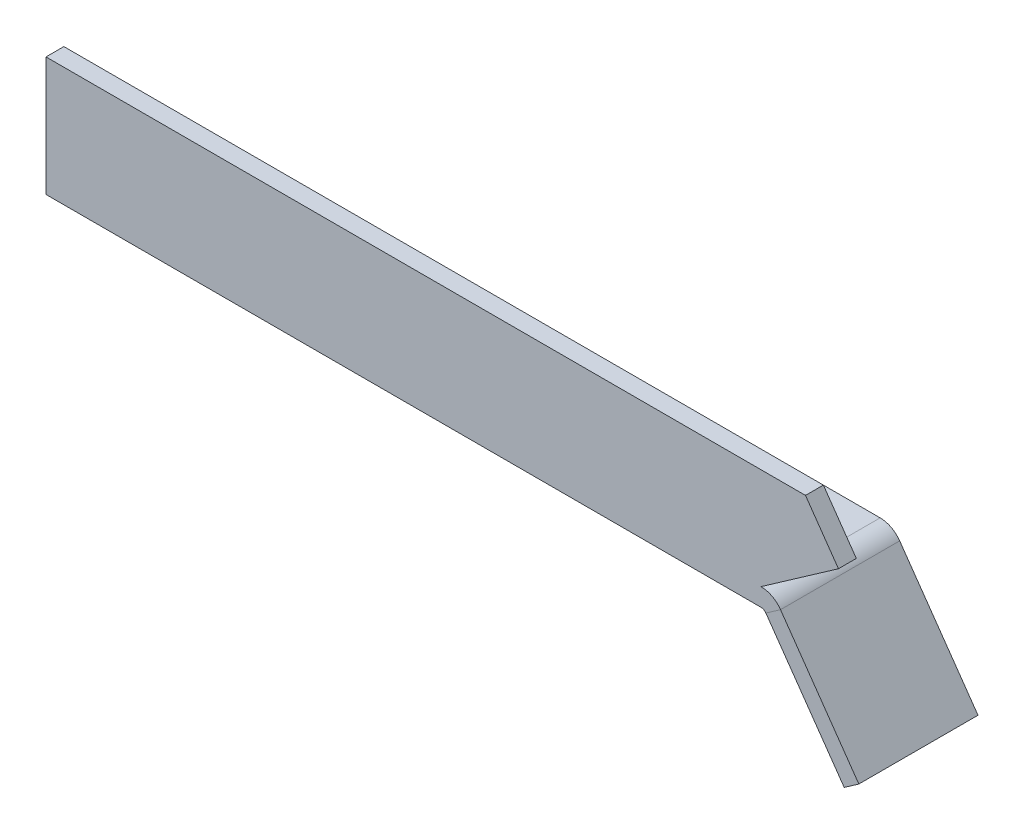
ISO-10303-21;
HEADER;
FILE_DESCRIPTION(('STEP AP214'),'2;1');
FILE_NAME('part.step','',(''),(''),'','','');
FILE_SCHEMA(('AUTOMOTIVE_DESIGN { 1 0 10303 214 1 1 1 1 }'));
ENDSEC;
DATA;
#1=APPLICATION_CONTEXT('core data for automotive mechanical design processes');
#2=APPLICATION_PROTOCOL_DEFINITION('international standard','automotive_design',2000,#1);
#3=PRODUCT_CONTEXT('',#1,'mechanical');
#4=PRODUCT('Part','Part','',(#3));
#5=PRODUCT_RELATED_PRODUCT_CATEGORY('part','',(#4));
#6=PRODUCT_DEFINITION_FORMATION('','',#4);
#7=PRODUCT_DEFINITION_CONTEXT('part definition',#1,'design');
#8=PRODUCT_DEFINITION('design','',#6,#7);
#9=PRODUCT_DEFINITION_SHAPE('','',#8);
#10=(LENGTH_UNIT() NAMED_UNIT(*) SI_UNIT(.MILLI.,.METRE.));
#11=(NAMED_UNIT(*) PLANE_ANGLE_UNIT() SI_UNIT($,.RADIAN.));
#12=(NAMED_UNIT(*) SI_UNIT($,.STERADIAN.) SOLID_ANGLE_UNIT());
#13=UNCERTAINTY_MEASURE_WITH_UNIT(LENGTH_MEASURE(1.E-05),#10,'distance_accuracy_value','');
#14=(GEOMETRIC_REPRESENTATION_CONTEXT(3) GLOBAL_UNCERTAINTY_ASSIGNED_CONTEXT((#13)) GLOBAL_UNIT_ASSIGNED_CONTEXT((#10,
#11,#12)) REPRESENTATION_CONTEXT('',''));
#15=CARTESIAN_POINT('',(0.,0.,0.));
#16=DIRECTION('',(0.,0.,1.));
#17=DIRECTION('',(1.,0.,0.));
#18=AXIS2_PLACEMENT_3D('',#15,#16,#17);
#19=CARTESIAN_POINT('',(120.,0.,0.));
#20=DIRECTION('',(0.,1.,0.));
#21=DIRECTION('',(0.,0.,1.));
#22=AXIS2_PLACEMENT_3D('',#19,#20,#21);
#23=PLANE('',#22);
#24=DIRECTION('',(0.,0.,-1.));
#25=VECTOR('',#24,1.);
#26=CARTESIAN_POINT('',(0.,0.,0.));
#27=LINE('',#26,#25);
#28=CARTESIAN_POINT('',(0.,0.,0.));
#29=VERTEX_POINT('',#28);
#30=CARTESIAN_POINT('',(0.,0.,-20.));
#31=VERTEX_POINT('',#30);
#32=EDGE_CURVE('E221',#29,#31,#27,.T.);
#33=ORIENTED_EDGE('',*,*,#32,.T.);
#34=DIRECTION('',(-1.,0.,0.));
#35=VECTOR('',#34,1.);
#36=CARTESIAN_POINT('',(120.,0.,-20.));
#37=LINE('',#36,#35);
#38=CARTESIAN_POINT('',(120.,0.,-20.));
#39=VERTEX_POINT('',#38);
#40=EDGE_CURVE('E13',#39,#31,#37,.T.);
#41=ORIENTED_EDGE('',*,*,#40,.F.);
#42=DIRECTION('',(0.,0.,-1.));
#43=VECTOR('',#42,1.);
#44=CARTESIAN_POINT('',(120.,0.,0.));
#45=LINE('',#44,#43);
#46=CARTESIAN_POINT('',(120.,0.,0.));
#47=VERTEX_POINT('',#46);
#48=EDGE_CURVE('E225',#47,#39,#45,.T.);
#49=ORIENTED_EDGE('',*,*,#48,.F.);
#50=DIRECTION('',(-1.,0.,0.));
#51=VECTOR('',#50,1.);
#52=CARTESIAN_POINT('',(120.,0.,0.));
#53=LINE('',#52,#51);
#54=EDGE_CURVE('E77',#47,#29,#53,.T.);
#55=ORIENTED_EDGE('',*,*,#54,.T.);
#56=EDGE_LOOP('',(#33,#41,#49,#55));
#57=FACE_BOUND('',#56,.T.);
#58=ADVANCED_FACE('F61',(#57),#23,.F.);
#59=CARTESIAN_POINT('',(120.,3.,-20.));
#60=DIRECTION('',(0.,0.,-1.));
#61=DIRECTION('',(-1.,0.,0.));
#62=AXIS2_PLACEMENT_3D('',#59,#60,#61);
#63=PLANE('',#62);
#64=DIRECTION('',(0.,-1.,0.));
#65=VECTOR('',#64,1.);
#66=CARTESIAN_POINT('',(0.,3.,-20.));
#67=LINE('',#66,#65);
#68=CARTESIAN_POINT('',(0.,3.,-20.));
#69=VERTEX_POINT('',#68);
#70=EDGE_CURVE('E231',#69,#31,#67,.T.);
#71=ORIENTED_EDGE('',*,*,#70,.F.);
#72=DIRECTION('',(-1.,0.,0.));
#73=VECTOR('',#72,1.);
#74=CARTESIAN_POINT('',(120.,3.,-20.));
#75=LINE('',#74,#73);
#76=CARTESIAN_POINT('',(120.,3.,-20.));
#77=VERTEX_POINT('',#76);
#78=EDGE_CURVE('E69',#77,#69,#75,.T.);
#79=ORIENTED_EDGE('',*,*,#78,.F.);
#80=CARTESIAN_POINT('',(120.,-1.00000000000001,-20.));
#81=DIRECTION('',(0.,0.,1.));
#82=DIRECTION('',(1.,0.,0.));
#83=AXIS2_PLACEMENT_3D('',#80,#81,#82);
#84=CIRCLE('',#83,4.00000000000003);
#85=CARTESIAN_POINT('',(123.276608177156,1.29430574540422,-20.));
#86=VERTEX_POINT('',#85);
#87=EDGE_CURVE('E159',#77,#86,#84,.F.);
#88=ORIENTED_EDGE('',*,*,#87,.T.);
#89=DIRECTION('',(0.819152044288989,0.57357643635105,0.));
#90=VECTOR('',#89,1.);
#91=CARTESIAN_POINT('',(123.276608177156,1.29430574540421,-20.));
#92=LINE('',#91,#90);
#93=CARTESIAN_POINT('',(120.819152044289,-0.42642356364894,-20.));
#94=VERTEX_POINT('',#93);
#95=EDGE_CURVE('E201',#94,#86,#92,.T.);
#96=ORIENTED_EDGE('',*,*,#95,.F.);
#97=CARTESIAN_POINT('',(120.,-1.00000000000001,-20.));
#98=DIRECTION('',(0.,0.,1.));
#99=DIRECTION('',(1.,0.,0.));
#100=AXIS2_PLACEMENT_3D('',#97,#98,#99);
#101=CIRCLE('',#100,1.00000000000003);
#102=EDGE_CURVE('E160',#39,#94,#101,.F.);
#103=ORIENTED_EDGE('',*,*,#102,.F.);
#104=ORIENTED_EDGE('',*,*,#40,.T.);
#105=EDGE_LOOP('',(#71,#79,#88,#96,#103,#104));
#106=FACE_BOUND('',#105,.T.);
#107=ADVANCED_FACE('F255',(#106),#63,.T.);
#108=CARTESIAN_POINT('',(120.,3.,0.));
#109=DIRECTION('',(0.,1.,0.));
#110=DIRECTION('',(0.,0.,1.));
#111=AXIS2_PLACEMENT_3D('',#108,#109,#110);
#112=PLANE('',#111);
#113=DIRECTION('',(0.,0.,-1.));
#114=VECTOR('',#113,1.);
#115=CARTESIAN_POINT('',(0.,3.,0.));
#116=LINE('',#115,#114);
#117=CARTESIAN_POINT('',(0.,3.,-3.));
#118=VERTEX_POINT('',#117);
#119=EDGE_CURVE('E234',#118,#69,#116,.T.);
#120=ORIENTED_EDGE('',*,*,#119,.F.);
#121=DIRECTION('',(-1.,0.,0.));
#122=VECTOR('',#121,1.);
#123=CARTESIAN_POINT('',(120.,3.,-3.));
#124=LINE('',#123,#122);
#125=CARTESIAN_POINT('',(120.,3.,-3.));
#126=VERTEX_POINT('',#125);
#127=EDGE_CURVE('E248',#126,#118,#124,.T.);
#128=ORIENTED_EDGE('',*,*,#127,.F.);
#129=DIRECTION('',(0.,0.,-1.));
#130=VECTOR('',#129,1.);
#131=CARTESIAN_POINT('',(120.,3.,0.));
#132=LINE('',#131,#130);
#133=EDGE_CURVE('E227',#126,#77,#132,.T.);
#134=ORIENTED_EDGE('',*,*,#133,.T.);
#135=ORIENTED_EDGE('',*,*,#78,.T.);
#136=EDGE_LOOP('',(#120,#128,#134,#135));
#137=FACE_BOUND('',#136,.T.);
#138=ADVANCED_FACE('F252',(#137),#112,.T.);
#139=CARTESIAN_POINT('',(120.,20.,-3.));
#140=DIRECTION('',(0.,0.,-1.));
#141=DIRECTION('',(0.,1.,0.));
#142=AXIS2_PLACEMENT_3D('',#139,#140,#141);
#143=PLANE('',#142);
#144=DIRECTION('',(0.,-1.,0.));
#145=VECTOR('',#144,1.);
#146=CARTESIAN_POINT('',(0.,20.,-3.));
#147=LINE('',#146,#145);
#148=CARTESIAN_POINT('',(0.,20.,-3.));
#149=VERTEX_POINT('',#148);
#150=EDGE_CURVE('E237',#149,#118,#147,.T.);
#151=ORIENTED_EDGE('',*,*,#150,.F.);
#152=DIRECTION('',(-1.,0.,0.));
#153=VECTOR('',#152,1.);
#154=CARTESIAN_POINT('',(120.,20.,-3.));
#155=LINE('',#154,#153);
#156=CARTESIAN_POINT('',(127.470249605789,20.,-3.));
#157=VERTEX_POINT('',#156);
#158=EDGE_CURVE('E246',#157,#149,#155,.T.);
#159=ORIENTED_EDGE('',*,*,#158,.F.);
#160=DIRECTION('',(-0.573576436351059,0.819152044288983,0.));
#161=VECTOR('',#160,1.);
#162=CARTESIAN_POINT('',(133.,12.1026979967263,-3.));
#163=LINE('',#162,#161);
#164=CARTESIAN_POINT('',(133.,12.1026979967263,-3.));
#165=VERTEX_POINT('',#164);
#166=EDGE_CURVE('E212',#165,#157,#163,.T.);
#167=ORIENTED_EDGE('',*,*,#166,.F.);
#168=DIRECTION('',(0.819152044288991,0.573576436351047,0.));
#169=VECTOR('',#168,1.);
#170=CARTESIAN_POINT('',(120.,3.,-3.));
#171=LINE('',#170,#169);
#172=EDGE_CURVE('E209',#126,#165,#171,.T.);
#173=ORIENTED_EDGE('',*,*,#172,.F.);
#174=ORIENTED_EDGE('',*,*,#127,.T.);
#175=EDGE_LOOP('',(#151,#159,#167,#173,#174));
#176=FACE_BOUND('',#175,.T.);
#177=ADVANCED_FACE('F263',(#176),#143,.T.);
#178=CARTESIAN_POINT('',(120.,20.,0.));
#179=DIRECTION('',(0.,1.,0.));
#180=DIRECTION('',(0.,0.,1.));
#181=AXIS2_PLACEMENT_3D('',#178,#179,#180);
#182=PLANE('',#181);
#183=DIRECTION('',(0.,0.,-1.));
#184=VECTOR('',#183,1.);
#185=CARTESIAN_POINT('',(0.,20.,0.));
#186=LINE('',#185,#184);
#187=CARTESIAN_POINT('',(0.,20.,0.));
#188=VERTEX_POINT('',#187);
#189=EDGE_CURVE('E240',#188,#149,#186,.T.);
#190=ORIENTED_EDGE('',*,*,#189,.F.);
#191=DIRECTION('',(-1.,0.,0.));
#192=VECTOR('',#191,1.);
#193=CARTESIAN_POINT('',(120.,20.,0.));
#194=LINE('',#193,#192);
#195=CARTESIAN_POINT('',(127.470249605789,20.,0.));
#196=VERTEX_POINT('',#195);
#197=EDGE_CURVE('E99',#196,#188,#194,.T.);
#198=ORIENTED_EDGE('',*,*,#197,.F.);
#199=DIRECTION('',(0.,0.,1.));
#200=VECTOR('',#199,1.);
#201=CARTESIAN_POINT('',(127.470249605789,20.,-3.));
#202=LINE('',#201,#200);
#203=EDGE_CURVE('E218',#157,#196,#202,.T.);
#204=ORIENTED_EDGE('',*,*,#203,.F.);
#205=ORIENTED_EDGE('',*,*,#158,.T.);
#206=EDGE_LOOP('',(#190,#198,#204,#205));
#207=FACE_BOUND('',#206,.T.);
#208=ADVANCED_FACE('F278',(#207),#182,.T.);
#209=CARTESIAN_POINT('',(120.,20.,0.));
#210=DIRECTION('',(0.,0.,-1.));
#211=DIRECTION('',(0.,1.,0.));
#212=AXIS2_PLACEMENT_3D('',#209,#210,#211);
#213=PLANE('',#212);
#214=ORIENTED_EDGE('',*,*,#54,.F.);
#215=CARTESIAN_POINT('',(120.,-1.00000000000001,0.));
#216=DIRECTION('',(0.,0.,1.));
#217=DIRECTION('',(1.,0.,0.));
#218=AXIS2_PLACEMENT_3D('',#215,#216,#217);
#219=CIRCLE('',#218,1.00000000000003);
#220=CARTESIAN_POINT('',(120.819152044289,-0.42642356364894,0.));
#221=VERTEX_POINT('',#220);
#222=EDGE_CURVE('E166',#221,#47,#219,.T.);
#223=ORIENTED_EDGE('',*,*,#222,.F.);
#224=DIRECTION('',(0.819152044288989,0.57357643635105,0.));
#225=VECTOR('',#224,1.);
#226=CARTESIAN_POINT('',(120.819152044289,-0.426423563648942,0.));
#227=LINE('',#226,#225);
#228=CARTESIAN_POINT('',(123.276608177156,1.29430574540421,0.));
#229=VERTEX_POINT('',#228);
#230=EDGE_CURVE('E163',#221,#229,#227,.T.);
#231=ORIENTED_EDGE('',*,*,#230,.T.);
#232=CARTESIAN_POINT('',(120.,-1.00000000000001,0.));
#233=DIRECTION('',(0.,0.,1.));
#234=DIRECTION('',(1.,0.,0.));
#235=AXIS2_PLACEMENT_3D('',#232,#233,#234);
#236=CIRCLE('',#235,4.00000000000003);
#237=CARTESIAN_POINT('',(120.,3.00000000000002,0.));
#238=VERTEX_POINT('',#237);
#239=EDGE_CURVE('E149',#229,#238,#236,.T.);
#240=ORIENTED_EDGE('',*,*,#239,.T.);
#241=DIRECTION('',(0.819152044288991,0.573576436351047,0.));
#242=VECTOR('',#241,1.);
#243=CARTESIAN_POINT('',(120.,3.,0.));
#244=LINE('',#243,#242);
#245=CARTESIAN_POINT('',(133.,12.1026979967263,0.));
#246=VERTEX_POINT('',#245);
#247=EDGE_CURVE('E204',#238,#246,#244,.T.);
#248=ORIENTED_EDGE('',*,*,#247,.T.);
#249=DIRECTION('',(-0.573576436351059,0.819152044288983,0.));
#250=VECTOR('',#249,1.);
#251=CARTESIAN_POINT('',(133.,12.1026979967263,0.));
#252=LINE('',#251,#250);
#253=EDGE_CURVE('E213',#246,#196,#252,.T.);
#254=ORIENTED_EDGE('',*,*,#253,.T.);
#255=ORIENTED_EDGE('',*,*,#197,.T.);
#256=DIRECTION('',(0.,-1.,0.));
#257=VECTOR('',#256,1.);
#258=CARTESIAN_POINT('',(0.,20.,0.));
#259=LINE('',#258,#257);
#260=EDGE_CURVE('E101',#188,#29,#259,.T.);
#261=ORIENTED_EDGE('',*,*,#260,.T.);
#262=EDGE_LOOP('',(#214,#223,#231,#240,#248,#254,#255,#261));
#263=FACE_BOUND('',#262,.T.);
#264=ADVANCED_FACE('F164',(#263),#213,.F.);
#265=CARTESIAN_POINT('',(0.,0.,0.));
#266=DIRECTION('',(-1.,0.,0.));
#267=DIRECTION('',(0.,0.,1.));
#268=AXIS2_PLACEMENT_3D('',#265,#266,#267);
#269=PLANE('',#268);
#270=ORIENTED_EDGE('',*,*,#32,.F.);
#271=ORIENTED_EDGE('',*,*,#260,.F.);
#272=ORIENTED_EDGE('',*,*,#189,.T.);
#273=ORIENTED_EDGE('',*,*,#150,.T.);
#274=ORIENTED_EDGE('',*,*,#119,.T.);
#275=ORIENTED_EDGE('',*,*,#70,.T.);
#276=EDGE_LOOP('',(#270,#271,#272,#273,#274,#275));
#277=FACE_BOUND('',#276,.T.);
#278=ADVANCED_FACE('F259',(#277),#269,.T.);
#279=CARTESIAN_POINT('',(133.,12.1026979967263,-3.));
#280=DIRECTION('',(0.819152044288983,0.573576436351059,0.));
#281=DIRECTION('',(-0.573576436351059,0.819152044288983,0.));
#282=AXIS2_PLACEMENT_3D('',#279,#280,#281);
#283=PLANE('',#282);
#284=ORIENTED_EDGE('',*,*,#253,.F.);
#285=DIRECTION('',(0.,0.,1.));
#286=VECTOR('',#285,1.);
#287=CARTESIAN_POINT('',(133.,12.1026979967263,-3.));
#288=LINE('',#287,#286);
#289=EDGE_CURVE('E222',#165,#246,#288,.T.);
#290=ORIENTED_EDGE('',*,*,#289,.F.);
#291=ORIENTED_EDGE('',*,*,#166,.T.);
#292=ORIENTED_EDGE('',*,*,#203,.T.);
#293=EDGE_LOOP('',(#284,#290,#291,#292));
#294=FACE_BOUND('',#293,.T.);
#295=ADVANCED_FACE('F281',(#294),#283,.T.);
#296=CARTESIAN_POINT('',(120.,3.,-3.));
#297=DIRECTION('',(0.573576436351047,-0.819152044288991,0.));
#298=DIRECTION('',(0.819152044288991,0.573576436351047,0.));
#299=AXIS2_PLACEMENT_3D('',#296,#297,#298);
#300=PLANE('',#299);
#301=ORIENTED_EDGE('',*,*,#247,.F.);
#302=DIRECTION('',(0.,0.,1.));
#303=VECTOR('',#302,1.);
#304=CARTESIAN_POINT('',(120.,3.,-3.));
#305=LINE('',#304,#303);
#306=EDGE_CURVE('E157',#126,#238,#305,.T.);
#307=ORIENTED_EDGE('',*,*,#306,.F.);
#308=ORIENTED_EDGE('',*,*,#172,.T.);
#309=ORIENTED_EDGE('',*,*,#289,.T.);
#310=EDGE_LOOP('',(#301,#307,#308,#309));
#311=FACE_BOUND('',#310,.T.);
#312=ADVANCED_FACE('F283',(#311),#300,.T.);
#313=CARTESIAN_POINT('',(120.,-1.00000000000001,0.));
#314=DIRECTION('',(0.,0.,1.));
#315=DIRECTION('',(0.819152044288989,0.57357643635105,0.));
#316=AXIS2_PLACEMENT_3D('',#313,#314,#315);
#317=CYLINDRICAL_SURFACE('',#316,4.00000000000003);
#318=ORIENTED_EDGE('',*,*,#133,.F.);
#319=ORIENTED_EDGE('',*,*,#306,.T.);
#320=ORIENTED_EDGE('',*,*,#239,.F.);
#321=DIRECTION('',(0.,0.,1.));
#322=VECTOR('',#321,1.);
#323=CARTESIAN_POINT('',(123.276608177156,1.29430574540421,0.));
#324=LINE('',#323,#322);
#325=EDGE_CURVE('E155',#86,#229,#324,.T.);
#326=ORIENTED_EDGE('',*,*,#325,.F.);
#327=ORIENTED_EDGE('',*,*,#87,.F.);
#328=EDGE_LOOP('',(#318,#319,#320,#326,#327));
#329=FACE_BOUND('',#328,.T.);
#330=ADVANCED_FACE('F152',(#329),#317,.T.);
#331=CARTESIAN_POINT('',(120.,-1.00000000000001,0.));
#332=DIRECTION('',(0.,0.,1.));
#333=DIRECTION('',(0.819152044288989,0.57357643635105,0.));
#334=AXIS2_PLACEMENT_3D('',#331,#332,#333);
#335=CYLINDRICAL_SURFACE('',#334,1.00000000000003);
#336=ORIENTED_EDGE('',*,*,#48,.T.);
#337=ORIENTED_EDGE('',*,*,#102,.T.);
#338=DIRECTION('',(0.,0.,-1.));
#339=VECTOR('',#338,1.);
#340=CARTESIAN_POINT('',(120.819152044289,-0.426423563648934,-20.));
#341=LINE('',#340,#339);
#342=EDGE_CURVE('E171',#94,#221,#341,.F.);
#343=ORIENTED_EDGE('',*,*,#342,.T.);
#344=ORIENTED_EDGE('',*,*,#222,.T.);
#345=EDGE_LOOP('',(#336,#337,#343,#344));
#346=FACE_BOUND('',#345,.T.);
#347=ADVANCED_FACE('F276',(#346),#335,.F.);
#348=CARTESIAN_POINT('',(122.978023183419,1.72072930905315,0.));
#349=DIRECTION('',(0.,0.,1.));
#350=DIRECTION('',(1.,0.,0.));
#351=AXIS2_PLACEMENT_3D('',#348,#349,#350);
#352=PLANE('',#351);
#353=DIRECTION('',(-0.57357643635105,0.819152044288989,0.));
#354=VECTOR('',#353,1.);
#355=CARTESIAN_POINT('',(122.978023183419,1.72072930905317,0.));
#356=LINE('',#355,#354);
#357=CARTESIAN_POINT('',(136.421679110983,-17.4788011072247,0.));
#358=VERTEX_POINT('',#357);
#359=EDGE_CURVE('E178',#358,#229,#356,.T.);
#360=ORIENTED_EDGE('',*,*,#359,.T.);
#361=ORIENTED_EDGE('',*,*,#230,.F.);
#362=DIRECTION('',(0.57357643635105,-0.819152044288989,0.));
#363=VECTOR('',#362,1.);
#364=CARTESIAN_POINT('',(81.0417756500913,56.3815572471547,0.));
#365=LINE('',#364,#363);
#366=CARTESIAN_POINT('',(133.964222978116,-19.1995304162779,0.));
#367=VERTEX_POINT('',#366);
#368=EDGE_CURVE('E194',#367,#221,#365,.F.);
#369=ORIENTED_EDGE('',*,*,#368,.F.);
#370=DIRECTION('',(-0.819152044288989,-0.57357643635105,0.));
#371=VECTOR('',#370,1.);
#372=CARTESIAN_POINT('',(136.421679110983,-17.4788011072247,0.));
#373=LINE('',#372,#371);
#374=EDGE_CURVE('E183',#358,#367,#373,.T.);
#375=ORIENTED_EDGE('',*,*,#374,.F.);
#376=EDGE_LOOP('',(#360,#361,#369,#375));
#377=FACE_BOUND('',#376,.T.);
#378=ADVANCED_FACE('F182',(#377),#352,.T.);
#379=CARTESIAN_POINT('',(136.421679110983,-17.4788011072247,-20.));
#380=DIRECTION('',(0.,0.,-1.));
#381=DIRECTION('',(-1.,0.,0.));
#382=AXIS2_PLACEMENT_3D('',#379,#380,#381);
#383=PLANE('',#382);
#384=DIRECTION('',(-0.57357643635105,0.819152044288989,0.));
#385=VECTOR('',#384,1.);
#386=CARTESIAN_POINT('',(81.0417756500913,56.3815572471547,-20.));
#387=LINE('',#386,#385);
#388=CARTESIAN_POINT('',(133.964222978116,-19.1995304162779,-20.));
#389=VERTEX_POINT('',#388);
#390=EDGE_CURVE('E180',#94,#389,#387,.F.);
#391=ORIENTED_EDGE('',*,*,#390,.F.);
#392=ORIENTED_EDGE('',*,*,#95,.T.);
#393=DIRECTION('',(0.57357643635105,-0.819152044288989,0.));
#394=VECTOR('',#393,1.);
#395=CARTESIAN_POINT('',(136.421679110983,-17.4788011072247,-20.));
#396=LINE('',#395,#394);
#397=CARTESIAN_POINT('',(136.421679110983,-17.4788011072247,-20.));
#398=VERTEX_POINT('',#397);
#399=EDGE_CURVE('E179',#86,#398,#396,.T.);
#400=ORIENTED_EDGE('',*,*,#399,.T.);
#401=DIRECTION('',(-0.819152044288989,-0.57357643635105,0.));
#402=VECTOR('',#401,1.);
#403=CARTESIAN_POINT('',(136.421679110983,-17.4788011072247,-20.));
#404=LINE('',#403,#402);
#405=EDGE_CURVE('E185',#398,#389,#404,.T.);
#406=ORIENTED_EDGE('',*,*,#405,.T.);
#407=EDGE_LOOP('',(#391,#392,#400,#406));
#408=FACE_BOUND('',#407,.T.);
#409=ADVANCED_FACE('F269',(#408),#383,.T.);
#410=CARTESIAN_POINT('',(83.4992317829583,58.1022865562079,0.));
#411=DIRECTION('',(0.819152044288989,0.57357643635105,0.));
#412=DIRECTION('',(-0.57357643635105,0.819152044288989,0.));
#413=AXIS2_PLACEMENT_3D('',#410,#411,#412);
#414=PLANE('',#413);
#415=ORIENTED_EDGE('',*,*,#399,.F.);
#416=ORIENTED_EDGE('',*,*,#325,.T.);
#417=ORIENTED_EDGE('',*,*,#359,.F.);
#418=DIRECTION('',(0.,0.,1.));
#419=VECTOR('',#418,1.);
#420=CARTESIAN_POINT('',(136.421679110983,-17.4788011072247,0.));
#421=LINE('',#420,#419);
#422=EDGE_CURVE('E186',#398,#358,#421,.T.);
#423=ORIENTED_EDGE('',*,*,#422,.F.);
#424=EDGE_LOOP('',(#415,#416,#417,#423));
#425=FACE_BOUND('',#424,.T.);
#426=ADVANCED_FACE('F176',(#425),#414,.T.);
#427=CARTESIAN_POINT('',(81.0417756500913,56.3815572471547,0.));
#428=DIRECTION('',(0.819152044288989,0.57357643635105,0.));
#429=DIRECTION('',(-0.57357643635105,0.819152044288989,0.));
#430=AXIS2_PLACEMENT_3D('',#427,#428,#429);
#431=PLANE('',#430);
#432=ORIENTED_EDGE('',*,*,#342,.F.);
#433=ORIENTED_EDGE('',*,*,#390,.T.);
#434=DIRECTION('',(0.,0.,-1.));
#435=VECTOR('',#434,1.);
#436=CARTESIAN_POINT('',(133.964222978116,-19.1995304162779,0.));
#437=LINE('',#436,#435);
#438=EDGE_CURVE('E196',#389,#367,#437,.F.);
#439=ORIENTED_EDGE('',*,*,#438,.T.);
#440=ORIENTED_EDGE('',*,*,#368,.T.);
#441=EDGE_LOOP('',(#432,#433,#439,#440));
#442=FACE_BOUND('',#441,.T.);
#443=ADVANCED_FACE('F274',(#442),#431,.F.);
#444=CARTESIAN_POINT('',(136.421679110983,-17.4788011072247,0.));
#445=DIRECTION('',(0.57357643635105,-0.819152044288989,0.));
#446=DIRECTION('',(0.819152044288989,0.57357643635105,0.));
#447=AXIS2_PLACEMENT_3D('',#444,#445,#446);
#448=PLANE('',#447);
#449=ORIENTED_EDGE('',*,*,#438,.F.);
#450=ORIENTED_EDGE('',*,*,#405,.F.);
#451=ORIENTED_EDGE('',*,*,#422,.T.);
#452=ORIENTED_EDGE('',*,*,#374,.T.);
#453=EDGE_LOOP('',(#449,#450,#451,#452));
#454=FACE_BOUND('',#453,.T.);
#455=ADVANCED_FACE('F370',(#454),#448,.T.);
#456=CLOSED_SHELL('',(#58,#107,#138,#177,#208,#264,#278,#295,#312,#330,#347,#378,#409,#426,#443,#455));
#457=MANIFOLD_SOLID_BREP('B2',#456);
#458=ADVANCED_BREP_SHAPE_REPRESENTATION('',(#18,#457),#14);
#459=SHAPE_DEFINITION_REPRESENTATION(#9,#458);
ENDSEC;
END-ISO-10303-21;
